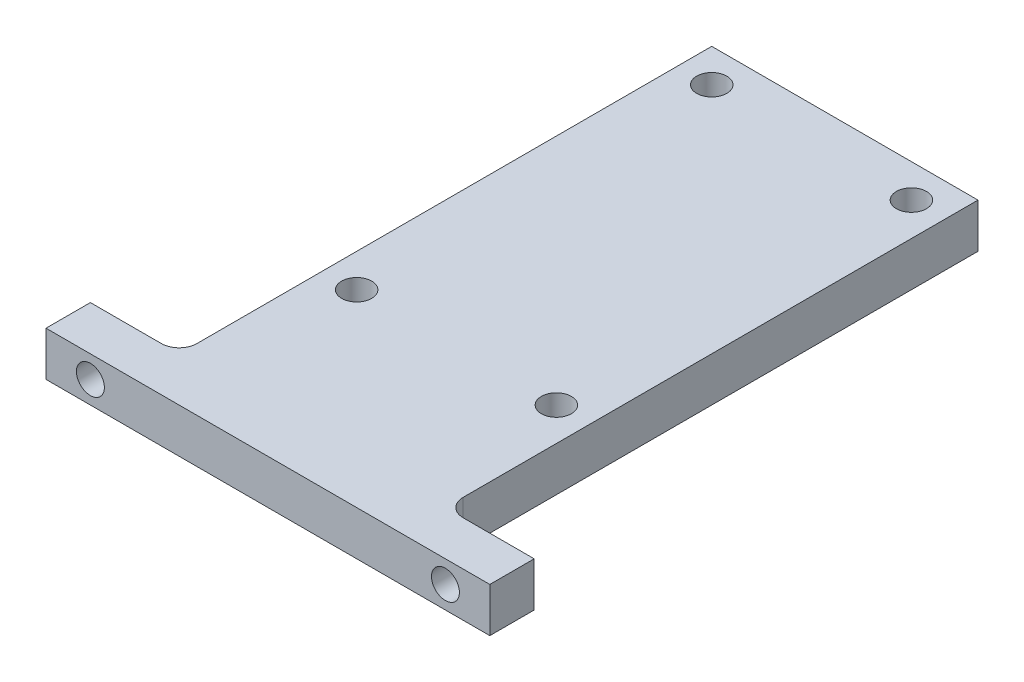
ISO-10303-21;
HEADER;
FILE_DESCRIPTION(('STEP AP214'),'2;1');
FILE_NAME('part.step','',(''),(''),'','','');
FILE_SCHEMA(('AUTOMOTIVE_DESIGN { 1 0 10303 214 1 1 1 1 }'));
ENDSEC;
DATA;
#1=APPLICATION_CONTEXT('core data for automotive mechanical design processes');
#2=APPLICATION_PROTOCOL_DEFINITION('international standard','automotive_design',2000,#1);
#3=PRODUCT_CONTEXT('',#1,'mechanical');
#4=PRODUCT('Part','Part','',(#3));
#5=PRODUCT_RELATED_PRODUCT_CATEGORY('part','',(#4));
#6=PRODUCT_DEFINITION_FORMATION('','',#4);
#7=PRODUCT_DEFINITION_CONTEXT('part definition',#1,'design');
#8=PRODUCT_DEFINITION('design','',#6,#7);
#9=PRODUCT_DEFINITION_SHAPE('','',#8);
#10=(LENGTH_UNIT() NAMED_UNIT(*) SI_UNIT(.MILLI.,.METRE.));
#11=(NAMED_UNIT(*) PLANE_ANGLE_UNIT() SI_UNIT($,.RADIAN.));
#12=(NAMED_UNIT(*) SI_UNIT($,.STERADIAN.) SOLID_ANGLE_UNIT());
#13=UNCERTAINTY_MEASURE_WITH_UNIT(LENGTH_MEASURE(1.E-05),#10,'distance_accuracy_value','');
#14=(GEOMETRIC_REPRESENTATION_CONTEXT(3) GLOBAL_UNCERTAINTY_ASSIGNED_CONTEXT((#13)) GLOBAL_UNIT_ASSIGNED_CONTEXT((#10,
#11,#12)) REPRESENTATION_CONTEXT('',''));
#15=CARTESIAN_POINT('',(0.,0.,0.));
#16=DIRECTION('',(0.,0.,1.));
#17=DIRECTION('',(1.,0.,0.));
#18=AXIS2_PLACEMENT_3D('',#15,#16,#17);
#19=CARTESIAN_POINT('',(0.,6.35,-6.35));
#20=DIRECTION('',(1.,0.,0.));
#21=DIRECTION('',(0.,0.,-1.));
#22=AXIS2_PLACEMENT_3D('',#19,#20,#21);
#23=PLANE('',#22);
#24=DIRECTION('',(0.,0.,1.));
#25=VECTOR('',#24,1.);
#26=CARTESIAN_POINT('',(0.,0.,-6.35));
#27=LINE('',#26,#25);
#28=CARTESIAN_POINT('',(0.,0.,-6.35));
#29=VERTEX_POINT('',#28);
#30=CARTESIAN_POINT('',(0.,0.,0.));
#31=VERTEX_POINT('',#30);
#32=EDGE_CURVE('E133',#29,#31,#27,.T.);
#33=ORIENTED_EDGE('',*,*,#32,.T.);
#34=DIRECTION('',(0.,-1.,0.));
#35=VECTOR('',#34,1.);
#36=CARTESIAN_POINT('',(0.,6.35,0.));
#37=LINE('',#36,#35);
#38=CARTESIAN_POINT('',(0.,6.35,0.));
#39=VERTEX_POINT('',#38);
#40=EDGE_CURVE('E114',#39,#31,#37,.T.);
#41=ORIENTED_EDGE('',*,*,#40,.F.);
#42=DIRECTION('',(0.,0.,1.));
#43=VECTOR('',#42,1.);
#44=CARTESIAN_POINT('',(0.,6.35,-6.35));
#45=LINE('',#44,#43);
#46=CARTESIAN_POINT('',(0.,6.35,-6.35));
#47=VERTEX_POINT('',#46);
#48=EDGE_CURVE('E121',#47,#39,#45,.T.);
#49=ORIENTED_EDGE('',*,*,#48,.F.);
#50=DIRECTION('',(0.,-1.,0.));
#51=VECTOR('',#50,1.);
#52=CARTESIAN_POINT('',(0.,6.35,-6.35));
#53=LINE('',#52,#51);
#54=EDGE_CURVE('E170',#47,#29,#53,.T.);
#55=ORIENTED_EDGE('',*,*,#54,.T.);
#56=EDGE_LOOP('',(#33,#41,#49,#55));
#57=FACE_BOUND('',#56,.T.);
#58=ADVANCED_FACE('F33',(#57),#23,.F.);
#59=CARTESIAN_POINT('',(0.,6.35,0.));
#60=DIRECTION('',(0.,0.,-1.));
#61=DIRECTION('',(-1.,0.,0.));
#62=AXIS2_PLACEMENT_3D('',#59,#60,#61);
#63=PLANE('',#62);
#64=CARTESIAN_POINT('',(6.35,3.175,0.));
#65=DIRECTION('',(0.,0.,-1.));
#66=DIRECTION('',(-1.,0.,0.));
#67=AXIS2_PLACEMENT_3D('',#64,#65,#66);
#68=CIRCLE('',#67,2.);
#69=CARTESIAN_POINT('',(4.35,3.175,0.));
#70=VERTEX_POINT('',#69);
#71=EDGE_CURVE('E146',#70,#70,#68,.T.);
#72=ORIENTED_EDGE('',*,*,#71,.T.);
#73=EDGE_LOOP('',(#72));
#74=FACE_BOUND('',#73,.T.);
#75=CARTESIAN_POINT('',(57.15,3.175,0.));
#76=DIRECTION('',(0.,0.,-1.));
#77=DIRECTION('',(-1.,0.,0.));
#78=AXIS2_PLACEMENT_3D('',#75,#76,#77);
#79=CIRCLE('',#78,2.);
#80=CARTESIAN_POINT('',(55.15,3.175,0.));
#81=VERTEX_POINT('',#80);
#82=EDGE_CURVE('E150',#81,#81,#79,.T.);
#83=ORIENTED_EDGE('',*,*,#82,.T.);
#84=EDGE_LOOP('',(#83));
#85=FACE_BOUND('',#84,.T.);
#86=DIRECTION('',(1.,0.,0.));
#87=VECTOR('',#86,1.);
#88=CARTESIAN_POINT('',(0.,0.,0.));
#89=LINE('',#88,#87);
#90=CARTESIAN_POINT('',(63.5,0.,0.));
#91=VERTEX_POINT('',#90);
#92=EDGE_CURVE('E203',#31,#91,#89,.T.);
#93=ORIENTED_EDGE('',*,*,#92,.T.);
#94=DIRECTION('',(0.,-1.,0.));
#95=VECTOR('',#94,1.);
#96=CARTESIAN_POINT('',(63.5,6.35,0.));
#97=LINE('',#96,#95);
#98=CARTESIAN_POINT('',(63.5,6.35,0.));
#99=VERTEX_POINT('',#98);
#100=EDGE_CURVE('E117',#99,#91,#97,.T.);
#101=ORIENTED_EDGE('',*,*,#100,.F.);
#102=DIRECTION('',(1.,0.,0.));
#103=VECTOR('',#102,1.);
#104=CARTESIAN_POINT('',(0.,6.35,0.));
#105=LINE('',#104,#103);
#106=EDGE_CURVE('E110',#39,#99,#105,.T.);
#107=ORIENTED_EDGE('',*,*,#106,.F.);
#108=ORIENTED_EDGE('',*,*,#40,.T.);
#109=EDGE_LOOP('',(#93,#101,#107,#108));
#110=FACE_BOUND('',#109,.T.);
#111=ADVANCED_FACE('F112',(#74,#85,#110),#63,.F.);
#112=CARTESIAN_POINT('',(63.5,6.35,0.));
#113=DIRECTION('',(-1.,0.,0.));
#114=DIRECTION('',(0.,0.,1.));
#115=AXIS2_PLACEMENT_3D('',#112,#113,#114);
#116=PLANE('',#115);
#117=DIRECTION('',(0.,0.,-1.));
#118=VECTOR('',#117,1.);
#119=CARTESIAN_POINT('',(63.5,0.,0.));
#120=LINE('',#119,#118);
#121=CARTESIAN_POINT('',(63.5,0.,-6.35000000000001));
#122=VERTEX_POINT('',#121);
#123=EDGE_CURVE('E201',#91,#122,#120,.T.);
#124=ORIENTED_EDGE('',*,*,#123,.T.);
#125=DIRECTION('',(0.,-1.,0.));
#126=VECTOR('',#125,1.);
#127=CARTESIAN_POINT('',(63.5,6.35,-6.35000000000001));
#128=LINE('',#127,#126);
#129=CARTESIAN_POINT('',(63.5,6.35,-6.35000000000001));
#130=VERTEX_POINT('',#129);
#131=EDGE_CURVE('E139',#130,#122,#128,.T.);
#132=ORIENTED_EDGE('',*,*,#131,.F.);
#133=DIRECTION('',(0.,0.,-1.));
#134=VECTOR('',#133,1.);
#135=CARTESIAN_POINT('',(63.5,6.35,0.));
#136=LINE('',#135,#134);
#137=EDGE_CURVE('E120',#99,#130,#136,.T.);
#138=ORIENTED_EDGE('',*,*,#137,.F.);
#139=ORIENTED_EDGE('',*,*,#100,.T.);
#140=EDGE_LOOP('',(#124,#132,#138,#139));
#141=FACE_BOUND('',#140,.T.);
#142=ADVANCED_FACE('F274',(#141),#116,.F.);
#143=CARTESIAN_POINT('',(63.5,6.35,-6.35000000000001));
#144=DIRECTION('',(0.,0.,1.));
#145=DIRECTION('',(1.,0.,0.));
#146=AXIS2_PLACEMENT_3D('',#143,#144,#145);
#147=PLANE('',#146);
#148=CARTESIAN_POINT('',(57.15,3.175,-6.35000000000001));
#149=DIRECTION('',(0.,0.,1.));
#150=DIRECTION('',(1.,0.,0.));
#151=AXIS2_PLACEMENT_3D('',#148,#149,#150);
#152=CIRCLE('',#151,2.);
#153=CARTESIAN_POINT('',(59.15,3.175,-6.35000000000001));
#154=VERTEX_POINT('',#153);
#155=EDGE_CURVE('E148',#154,#154,#152,.T.);
#156=ORIENTED_EDGE('',*,*,#155,.T.);
#157=EDGE_LOOP('',(#156));
#158=FACE_BOUND('',#157,.T.);
#159=DIRECTION('',(-1.,0.,0.));
#160=VECTOR('',#159,1.);
#161=CARTESIAN_POINT('',(63.5,0.,-6.35000000000001));
#162=LINE('',#161,#160);
#163=CARTESIAN_POINT('',(53.34,0.,-6.35000000000001));
#164=VERTEX_POINT('',#163);
#165=EDGE_CURVE('E197',#122,#164,#162,.T.);
#166=ORIENTED_EDGE('',*,*,#165,.T.);
#167=DIRECTION('',(0.,-1.,0.));
#168=VECTOR('',#167,1.);
#169=CARTESIAN_POINT('',(53.34,6.35,-6.35000000000001));
#170=LINE('',#169,#168);
#171=CARTESIAN_POINT('',(53.34,6.35,-6.35000000000001));
#172=VERTEX_POINT('',#171);
#173=EDGE_CURVE('E48',#164,#172,#170,.F.);
#174=ORIENTED_EDGE('',*,*,#173,.T.);
#175=DIRECTION('',(-1.,0.,0.));
#176=VECTOR('',#175,1.);
#177=CARTESIAN_POINT('',(63.5,6.35,-6.35000000000001));
#178=LINE('',#177,#176);
#179=EDGE_CURVE('E198',#130,#172,#178,.T.);
#180=ORIENTED_EDGE('',*,*,#179,.F.);
#181=ORIENTED_EDGE('',*,*,#131,.T.);
#182=EDGE_LOOP('',(#166,#174,#180,#181));
#183=FACE_BOUND('',#182,.T.);
#184=ADVANCED_FACE('F196',(#158,#183),#147,.F.);
#185=CARTESIAN_POINT('',(50.8,6.35,-6.35000000000001));
#186=DIRECTION('',(-1.,0.,0.));
#187=DIRECTION('',(0.,0.,1.));
#188=AXIS2_PLACEMENT_3D('',#185,#186,#187);
#189=PLANE('',#188);
#190=DIRECTION('',(0.,0.,-1.));
#191=VECTOR('',#190,1.);
#192=CARTESIAN_POINT('',(50.8,6.35,-6.35000000000001));
#193=LINE('',#192,#191);
#194=CARTESIAN_POINT('',(50.8,6.35,-8.89000000000001));
#195=VERTEX_POINT('',#194);
#196=CARTESIAN_POINT('',(50.8,6.35,-82.55));
#197=VERTEX_POINT('',#196);
#198=EDGE_CURVE('E211',#195,#197,#193,.T.);
#199=ORIENTED_EDGE('',*,*,#198,.F.);
#200=DIRECTION('',(0.,-1.,0.));
#201=VECTOR('',#200,1.);
#202=CARTESIAN_POINT('',(50.8,0.,-8.89000000000001));
#203=LINE('',#202,#201);
#204=CARTESIAN_POINT('',(50.8,0.,-8.89000000000001));
#205=VERTEX_POINT('',#204);
#206=EDGE_CURVE('E153',#195,#205,#203,.T.);
#207=ORIENTED_EDGE('',*,*,#206,.T.);
#208=DIRECTION('',(0.,0.,-1.));
#209=VECTOR('',#208,1.);
#210=CARTESIAN_POINT('',(50.8,0.,-6.35000000000001));
#211=LINE('',#210,#209);
#212=CARTESIAN_POINT('',(50.8,0.,-82.55));
#213=VERTEX_POINT('',#212);
#214=EDGE_CURVE('E186',#205,#213,#211,.T.);
#215=ORIENTED_EDGE('',*,*,#214,.T.);
#216=DIRECTION('',(0.,-1.,0.));
#217=VECTOR('',#216,1.);
#218=CARTESIAN_POINT('',(50.8,6.35,-82.55));
#219=LINE('',#218,#217);
#220=EDGE_CURVE('E192',#197,#213,#219,.T.);
#221=ORIENTED_EDGE('',*,*,#220,.F.);
#222=EDGE_LOOP('',(#199,#207,#215,#221));
#223=FACE_BOUND('',#222,.T.);
#224=ADVANCED_FACE('F304',(#223),#189,.F.);
#225=CARTESIAN_POINT('',(50.8,6.35,-82.55));
#226=DIRECTION('',(0.,0.,1.));
#227=DIRECTION('',(1.,0.,0.));
#228=AXIS2_PLACEMENT_3D('',#225,#226,#227);
#229=PLANE('',#228);
#230=DIRECTION('',(-1.,0.,0.));
#231=VECTOR('',#230,1.);
#232=CARTESIAN_POINT('',(50.8,0.,-82.55));
#233=LINE('',#232,#231);
#234=CARTESIAN_POINT('',(12.7,0.,-82.55));
#235=VERTEX_POINT('',#234);
#236=EDGE_CURVE('E183',#213,#235,#233,.T.);
#237=ORIENTED_EDGE('',*,*,#236,.T.);
#238=DIRECTION('',(0.,-1.,0.));
#239=VECTOR('',#238,1.);
#240=CARTESIAN_POINT('',(12.7,6.35,-82.55));
#241=LINE('',#240,#239);
#242=CARTESIAN_POINT('',(12.7,6.35,-82.55));
#243=VERTEX_POINT('',#242);
#244=EDGE_CURVE('E182',#243,#235,#241,.T.);
#245=ORIENTED_EDGE('',*,*,#244,.F.);
#246=DIRECTION('',(-1.,0.,0.));
#247=VECTOR('',#246,1.);
#248=CARTESIAN_POINT('',(50.8,6.35,-82.55));
#249=LINE('',#248,#247);
#250=EDGE_CURVE('E209',#197,#243,#249,.T.);
#251=ORIENTED_EDGE('',*,*,#250,.F.);
#252=ORIENTED_EDGE('',*,*,#220,.T.);
#253=EDGE_LOOP('',(#237,#245,#251,#252));
#254=FACE_BOUND('',#253,.T.);
#255=ADVANCED_FACE('F301',(#254),#229,.F.);
#256=CARTESIAN_POINT('',(12.7,6.35,-82.55));
#257=DIRECTION('',(1.,0.,0.));
#258=DIRECTION('',(0.,0.,-1.));
#259=AXIS2_PLACEMENT_3D('',#256,#257,#258);
#260=PLANE('',#259);
#261=DIRECTION('',(0.,0.,1.));
#262=VECTOR('',#261,1.);
#263=CARTESIAN_POINT('',(12.7,0.,-82.55));
#264=LINE('',#263,#262);
#265=CARTESIAN_POINT('',(12.7,0.,-8.89000000000001));
#266=VERTEX_POINT('',#265);
#267=EDGE_CURVE('E177',#235,#266,#264,.T.);
#268=ORIENTED_EDGE('',*,*,#267,.T.);
#269=DIRECTION('',(0.,-1.,0.));
#270=VECTOR('',#269,1.);
#271=CARTESIAN_POINT('',(12.7,6.35,-8.89));
#272=LINE('',#271,#270);
#273=CARTESIAN_POINT('',(12.7,6.35,-8.89000000000001));
#274=VERTEX_POINT('',#273);
#275=EDGE_CURVE('E137',#266,#274,#272,.F.);
#276=ORIENTED_EDGE('',*,*,#275,.T.);
#277=DIRECTION('',(0.,0.,1.));
#278=VECTOR('',#277,1.);
#279=CARTESIAN_POINT('',(12.7,6.35,-82.55));
#280=LINE('',#279,#278);
#281=EDGE_CURVE('E163',#243,#274,#280,.T.);
#282=ORIENTED_EDGE('',*,*,#281,.F.);
#283=ORIENTED_EDGE('',*,*,#244,.T.);
#284=EDGE_LOOP('',(#268,#276,#282,#283));
#285=FACE_BOUND('',#284,.T.);
#286=ADVANCED_FACE('F180',(#285),#260,.F.);
#287=CARTESIAN_POINT('',(12.7,6.35,-6.35));
#288=DIRECTION('',(0.,0.,1.));
#289=DIRECTION('',(1.,0.,0.));
#290=AXIS2_PLACEMENT_3D('',#287,#288,#289);
#291=PLANE('',#290);
#292=CARTESIAN_POINT('',(6.35,3.175,-6.34999999999999));
#293=DIRECTION('',(0.,0.,1.));
#294=DIRECTION('',(1.,0.,0.));
#295=AXIS2_PLACEMENT_3D('',#292,#293,#294);
#296=CIRCLE('',#295,2.);
#297=CARTESIAN_POINT('',(8.35,3.175,-6.34999999999999));
#298=VERTEX_POINT('',#297);
#299=EDGE_CURVE('E143',#298,#298,#296,.T.);
#300=ORIENTED_EDGE('',*,*,#299,.T.);
#301=EDGE_LOOP('',(#300));
#302=FACE_BOUND('',#301,.T.);
#303=DIRECTION('',(-1.,0.,0.));
#304=VECTOR('',#303,1.);
#305=CARTESIAN_POINT('',(12.7,6.35,-6.35));
#306=LINE('',#305,#304);
#307=CARTESIAN_POINT('',(10.16,6.35,-6.35));
#308=VERTEX_POINT('',#307);
#309=EDGE_CURVE('E126',#308,#47,#306,.T.);
#310=ORIENTED_EDGE('',*,*,#309,.F.);
#311=DIRECTION('',(0.,-1.,0.));
#312=VECTOR('',#311,1.);
#313=CARTESIAN_POINT('',(10.16,0.,-6.35));
#314=LINE('',#313,#312);
#315=CARTESIAN_POINT('',(10.16,0.,-6.35));
#316=VERTEX_POINT('',#315);
#317=EDGE_CURVE('E134',#308,#316,#314,.T.);
#318=ORIENTED_EDGE('',*,*,#317,.T.);
#319=DIRECTION('',(-1.,0.,0.));
#320=VECTOR('',#319,1.);
#321=CARTESIAN_POINT('',(12.7,0.,-6.35));
#322=LINE('',#321,#320);
#323=EDGE_CURVE('E130',#316,#29,#322,.T.);
#324=ORIENTED_EDGE('',*,*,#323,.T.);
#325=ORIENTED_EDGE('',*,*,#54,.F.);
#326=EDGE_LOOP('',(#310,#318,#324,#325));
#327=FACE_BOUND('',#326,.T.);
#328=ADVANCED_FACE('F168',(#302,#327),#291,.F.);
#329=CARTESIAN_POINT('',(0.,6.35,0.));
#330=DIRECTION('',(0.,1.,0.));
#331=DIRECTION('',(0.,0.,1.));
#332=AXIS2_PLACEMENT_3D('',#329,#330,#331);
#333=PLANE('',#332);
#334=CARTESIAN_POINT('',(17.4625,6.35,-77.7875));
#335=DIRECTION('',(0.,1.,0.));
#336=DIRECTION('',(0.,0.,1.));
#337=AXIS2_PLACEMENT_3D('',#334,#335,#336);
#338=CIRCLE('',#337,2.15);
#339=CARTESIAN_POINT('',(17.4625,6.35,-75.6375));
#340=VERTEX_POINT('',#339);
#341=EDGE_CURVE('E239',#340,#340,#338,.T.);
#342=ORIENTED_EDGE('',*,*,#341,.F.);
#343=EDGE_LOOP('',(#342));
#344=FACE_BOUND('',#343,.T.);
#345=CARTESIAN_POINT('',(46.0375,6.35,-77.7875));
#346=DIRECTION('',(0.,1.,0.));
#347=DIRECTION('',(0.,0.,1.));
#348=AXIS2_PLACEMENT_3D('',#345,#346,#347);
#349=CIRCLE('',#348,2.15);
#350=CARTESIAN_POINT('',(46.0375,6.35,-75.6375));
#351=VERTEX_POINT('',#350);
#352=EDGE_CURVE('E233',#351,#351,#349,.T.);
#353=ORIENTED_EDGE('',*,*,#352,.F.);
#354=EDGE_LOOP('',(#353));
#355=FACE_BOUND('',#354,.T.);
#356=CARTESIAN_POINT('',(46.0375,6.35,-26.9875));
#357=DIRECTION('',(0.,1.,0.));
#358=DIRECTION('',(0.,0.,1.));
#359=AXIS2_PLACEMENT_3D('',#356,#357,#358);
#360=CIRCLE('',#359,2.15);
#361=CARTESIAN_POINT('',(46.0375,6.35,-24.8375));
#362=VERTEX_POINT('',#361);
#363=EDGE_CURVE('E227',#362,#362,#360,.T.);
#364=ORIENTED_EDGE('',*,*,#363,.F.);
#365=EDGE_LOOP('',(#364));
#366=FACE_BOUND('',#365,.T.);
#367=CARTESIAN_POINT('',(17.4625,6.35,-26.9875));
#368=DIRECTION('',(0.,1.,0.));
#369=DIRECTION('',(0.,0.,1.));
#370=AXIS2_PLACEMENT_3D('',#367,#368,#369);
#371=CIRCLE('',#370,2.15);
#372=CARTESIAN_POINT('',(17.4625,6.35,-24.8375));
#373=VERTEX_POINT('',#372);
#374=EDGE_CURVE('E221',#373,#373,#371,.T.);
#375=ORIENTED_EDGE('',*,*,#374,.F.);
#376=EDGE_LOOP('',(#375));
#377=FACE_BOUND('',#376,.T.);
#378=ORIENTED_EDGE('',*,*,#48,.T.);
#379=ORIENTED_EDGE('',*,*,#106,.T.);
#380=ORIENTED_EDGE('',*,*,#137,.T.);
#381=ORIENTED_EDGE('',*,*,#179,.T.);
#382=CARTESIAN_POINT('',(53.34,6.35,-8.89000000000001));
#383=DIRECTION('',(0.,1.,0.));
#384=DIRECTION('',(0.,0.,1.));
#385=AXIS2_PLACEMENT_3D('',#382,#383,#384);
#386=CIRCLE('',#385,2.54);
#387=EDGE_CURVE('E11',#172,#195,#386,.F.);
#388=ORIENTED_EDGE('',*,*,#387,.T.);
#389=ORIENTED_EDGE('',*,*,#198,.T.);
#390=ORIENTED_EDGE('',*,*,#250,.T.);
#391=ORIENTED_EDGE('',*,*,#281,.T.);
#392=CARTESIAN_POINT('',(10.16,6.35,-8.89));
#393=DIRECTION('',(0.,1.,0.));
#394=DIRECTION('',(0.,0.,1.));
#395=AXIS2_PLACEMENT_3D('',#392,#393,#394);
#396=CIRCLE('',#395,2.54);
#397=EDGE_CURVE('E159',#274,#308,#396,.F.);
#398=ORIENTED_EDGE('',*,*,#397,.T.);
#399=ORIENTED_EDGE('',*,*,#309,.T.);
#400=EDGE_LOOP('',(#378,#379,#380,#381,#388,#389,#390,#391,#398,#399));
#401=FACE_BOUND('',#400,.T.);
#402=ADVANCED_FACE('F124',(#344,#355,#366,#377,#401),#333,.T.);
#403=CARTESIAN_POINT('',(0.,0.,0.));
#404=DIRECTION('',(0.,1.,0.));
#405=DIRECTION('',(0.,0.,1.));
#406=AXIS2_PLACEMENT_3D('',#403,#404,#405);
#407=PLANE('',#406);
#408=CARTESIAN_POINT('',(17.4625,0.,-77.7875));
#409=DIRECTION('',(0.,1.,0.));
#410=DIRECTION('',(0.,0.,1.));
#411=AXIS2_PLACEMENT_3D('',#408,#409,#410);
#412=CIRCLE('',#411,2.15);
#413=CARTESIAN_POINT('',(17.4625,0.,-75.6375));
#414=VERTEX_POINT('',#413);
#415=EDGE_CURVE('E236',#414,#414,#412,.T.);
#416=ORIENTED_EDGE('',*,*,#415,.T.);
#417=EDGE_LOOP('',(#416));
#418=FACE_BOUND('',#417,.T.);
#419=CARTESIAN_POINT('',(46.0375,0.,-77.7875));
#420=DIRECTION('',(0.,1.,0.));
#421=DIRECTION('',(0.,0.,1.));
#422=AXIS2_PLACEMENT_3D('',#419,#420,#421);
#423=CIRCLE('',#422,2.15);
#424=CARTESIAN_POINT('',(46.0375,0.,-75.6375));
#425=VERTEX_POINT('',#424);
#426=EDGE_CURVE('E230',#425,#425,#423,.T.);
#427=ORIENTED_EDGE('',*,*,#426,.T.);
#428=EDGE_LOOP('',(#427));
#429=FACE_BOUND('',#428,.T.);
#430=CARTESIAN_POINT('',(46.0375,0.,-26.9875));
#431=DIRECTION('',(0.,1.,0.));
#432=DIRECTION('',(0.,0.,1.));
#433=AXIS2_PLACEMENT_3D('',#430,#431,#432);
#434=CIRCLE('',#433,2.15);
#435=CARTESIAN_POINT('',(46.0375,0.,-24.8375));
#436=VERTEX_POINT('',#435);
#437=EDGE_CURVE('E224',#436,#436,#434,.T.);
#438=ORIENTED_EDGE('',*,*,#437,.T.);
#439=EDGE_LOOP('',(#438));
#440=FACE_BOUND('',#439,.T.);
#441=CARTESIAN_POINT('',(17.4625,0.,-26.9875));
#442=DIRECTION('',(0.,1.,0.));
#443=DIRECTION('',(0.,0.,1.));
#444=AXIS2_PLACEMENT_3D('',#441,#442,#443);
#445=CIRCLE('',#444,2.15);
#446=CARTESIAN_POINT('',(17.4625,0.,-24.8375));
#447=VERTEX_POINT('',#446);
#448=EDGE_CURVE('E147',#447,#447,#445,.T.);
#449=ORIENTED_EDGE('',*,*,#448,.T.);
#450=EDGE_LOOP('',(#449));
#451=FACE_BOUND('',#450,.T.);
#452=ORIENTED_EDGE('',*,*,#32,.F.);
#453=ORIENTED_EDGE('',*,*,#323,.F.);
#454=CARTESIAN_POINT('',(10.16,0.,-8.89));
#455=DIRECTION('',(0.,1.,0.));
#456=DIRECTION('',(0.,0.,1.));
#457=AXIS2_PLACEMENT_3D('',#454,#455,#456);
#458=CIRCLE('',#457,2.54);
#459=EDGE_CURVE('E157',#316,#266,#458,.T.);
#460=ORIENTED_EDGE('',*,*,#459,.T.);
#461=ORIENTED_EDGE('',*,*,#267,.F.);
#462=ORIENTED_EDGE('',*,*,#236,.F.);
#463=ORIENTED_EDGE('',*,*,#214,.F.);
#464=CARTESIAN_POINT('',(53.34,0.,-8.89000000000001));
#465=DIRECTION('',(0.,1.,0.));
#466=DIRECTION('',(0.,0.,1.));
#467=AXIS2_PLACEMENT_3D('',#464,#465,#466);
#468=CIRCLE('',#467,2.54);
#469=EDGE_CURVE('E41',#205,#164,#468,.T.);
#470=ORIENTED_EDGE('',*,*,#469,.T.);
#471=ORIENTED_EDGE('',*,*,#165,.F.);
#472=ORIENTED_EDGE('',*,*,#123,.F.);
#473=ORIENTED_EDGE('',*,*,#92,.F.);
#474=EDGE_LOOP('',(#452,#453,#460,#461,#462,#463,#470,#471,#472,#473));
#475=FACE_BOUND('',#474,.T.);
#476=ADVANCED_FACE('F175',(#418,#429,#440,#451,#475),#407,.F.);
#477=CARTESIAN_POINT('',(6.35,3.175,-82.55));
#478=DIRECTION('',(0.,0.,1.));
#479=DIRECTION('',(1.,0.,0.));
#480=AXIS2_PLACEMENT_3D('',#477,#478,#479);
#481=CYLINDRICAL_SURFACE('',#480,2.);
#482=ORIENTED_EDGE('',*,*,#299,.F.);
#483=EDGE_LOOP('',(#482));
#484=FACE_BOUND('',#483,.T.);
#485=ORIENTED_EDGE('',*,*,#71,.F.);
#486=EDGE_LOOP('',(#485));
#487=FACE_BOUND('',#486,.T.);
#488=ADVANCED_FACE('F283',(#484,#487),#481,.F.);
#489=CARTESIAN_POINT('',(57.15,3.175,-82.55));
#490=DIRECTION('',(0.,0.,1.));
#491=DIRECTION('',(1.,0.,0.));
#492=AXIS2_PLACEMENT_3D('',#489,#490,#491);
#493=CYLINDRICAL_SURFACE('',#492,2.);
#494=ORIENTED_EDGE('',*,*,#155,.F.);
#495=EDGE_LOOP('',(#494));
#496=FACE_BOUND('',#495,.T.);
#497=ORIENTED_EDGE('',*,*,#82,.F.);
#498=EDGE_LOOP('',(#497));
#499=FACE_BOUND('',#498,.T.);
#500=ADVANCED_FACE('F279',(#496,#499),#493,.F.);
#501=CARTESIAN_POINT('',(10.16,6.35,-8.89));
#502=DIRECTION('',(0.,1.,0.));
#503=DIRECTION('',(0.,0.,1.));
#504=AXIS2_PLACEMENT_3D('',#501,#502,#503);
#505=CYLINDRICAL_SURFACE('',#504,2.54);
#506=ORIENTED_EDGE('',*,*,#397,.F.);
#507=ORIENTED_EDGE('',*,*,#275,.F.);
#508=ORIENTED_EDGE('',*,*,#459,.F.);
#509=ORIENTED_EDGE('',*,*,#317,.F.);
#510=EDGE_LOOP('',(#506,#507,#508,#509));
#511=FACE_BOUND('',#510,.T.);
#512=ADVANCED_FACE('F172',(#511),#505,.F.);
#513=CARTESIAN_POINT('',(53.34,6.35,-8.89000000000001));
#514=DIRECTION('',(0.,1.,0.));
#515=DIRECTION('',(0.,0.,1.));
#516=AXIS2_PLACEMENT_3D('',#513,#514,#515);
#517=CYLINDRICAL_SURFACE('',#516,2.54);
#518=ORIENTED_EDGE('',*,*,#387,.F.);
#519=ORIENTED_EDGE('',*,*,#173,.F.);
#520=ORIENTED_EDGE('',*,*,#469,.F.);
#521=ORIENTED_EDGE('',*,*,#206,.F.);
#522=EDGE_LOOP('',(#518,#519,#520,#521));
#523=FACE_BOUND('',#522,.T.);
#524=ADVANCED_FACE('F35',(#523),#517,.F.);
#525=CARTESIAN_POINT('',(17.4625,6.35,-26.9875));
#526=DIRECTION('',(0.,1.,0.));
#527=DIRECTION('',(0.,0.,1.));
#528=AXIS2_PLACEMENT_3D('',#525,#526,#527);
#529=CYLINDRICAL_SURFACE('',#528,2.15);
#530=ORIENTED_EDGE('',*,*,#448,.F.);
#531=EDGE_LOOP('',(#530));
#532=FACE_BOUND('',#531,.T.);
#533=ORIENTED_EDGE('',*,*,#374,.T.);
#534=EDGE_LOOP('',(#533));
#535=FACE_BOUND('',#534,.T.);
#536=ADVANCED_FACE('F254',(#532,#535),#529,.F.);
#537=CARTESIAN_POINT('',(46.0375,6.35,-26.9875));
#538=DIRECTION('',(0.,1.,0.));
#539=DIRECTION('',(0.,0.,1.));
#540=AXIS2_PLACEMENT_3D('',#537,#538,#539);
#541=CYLINDRICAL_SURFACE('',#540,2.15);
#542=ORIENTED_EDGE('',*,*,#437,.F.);
#543=EDGE_LOOP('',(#542));
#544=FACE_BOUND('',#543,.T.);
#545=ORIENTED_EDGE('',*,*,#363,.T.);
#546=EDGE_LOOP('',(#545));
#547=FACE_BOUND('',#546,.T.);
#548=ADVANCED_FACE('F256',(#544,#547),#541,.F.);
#549=CARTESIAN_POINT('',(46.0375,6.35,-77.7875));
#550=DIRECTION('',(0.,1.,0.));
#551=DIRECTION('',(0.,0.,1.));
#552=AXIS2_PLACEMENT_3D('',#549,#550,#551);
#553=CYLINDRICAL_SURFACE('',#552,2.15);
#554=ORIENTED_EDGE('',*,*,#426,.F.);
#555=EDGE_LOOP('',(#554));
#556=FACE_BOUND('',#555,.T.);
#557=ORIENTED_EDGE('',*,*,#352,.T.);
#558=EDGE_LOOP('',(#557));
#559=FACE_BOUND('',#558,.T.);
#560=ADVANCED_FACE('F263',(#556,#559),#553,.F.);
#561=CARTESIAN_POINT('',(17.4625,6.35,-77.7875));
#562=DIRECTION('',(0.,1.,0.));
#563=DIRECTION('',(0.,0.,1.));
#564=AXIS2_PLACEMENT_3D('',#561,#562,#563);
#565=CYLINDRICAL_SURFACE('',#564,2.15);
#566=ORIENTED_EDGE('',*,*,#415,.F.);
#567=EDGE_LOOP('',(#566));
#568=FACE_BOUND('',#567,.T.);
#569=ORIENTED_EDGE('',*,*,#341,.T.);
#570=EDGE_LOOP('',(#569));
#571=FACE_BOUND('',#570,.T.);
#572=ADVANCED_FACE('F243',(#568,#571),#565,.F.);
#573=CLOSED_SHELL('',(#58,#111,#142,#184,#224,#255,#286,#328,#402,#476,#488,#500,#512,#524,#536,
#548,#560,#572));
#574=MANIFOLD_SOLID_BREP('B2',#573);
#575=ADVANCED_BREP_SHAPE_REPRESENTATION('',(#18,#574),#14);
#576=SHAPE_DEFINITION_REPRESENTATION(#9,#575);
ENDSEC;
END-ISO-10303-21;
